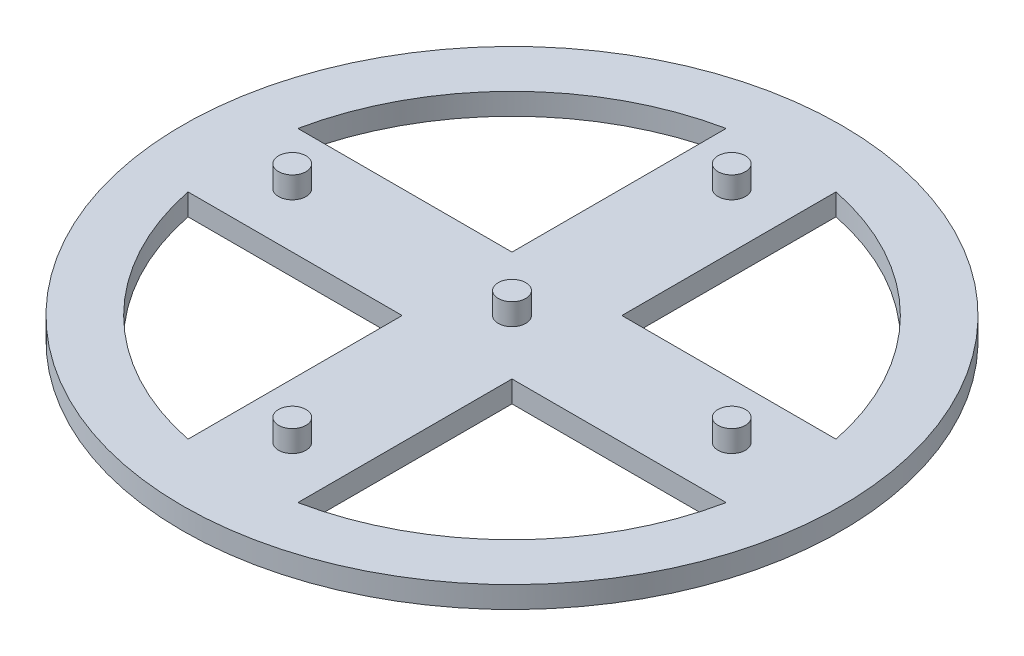
ISO-10303-21;
HEADER;
FILE_DESCRIPTION(('STEP AP214'),'2;1');
FILE_NAME('part.step','',(''),(''),'','','');
FILE_SCHEMA(('AUTOMOTIVE_DESIGN { 1 0 10303 214 1 1 1 1 }'));
ENDSEC;
DATA;
#1=APPLICATION_CONTEXT('core data for automotive mechanical design processes');
#2=APPLICATION_PROTOCOL_DEFINITION('international standard','automotive_design',2000,#1);
#3=PRODUCT_CONTEXT('',#1,'mechanical');
#4=PRODUCT('Part','Part','',(#3));
#5=PRODUCT_RELATED_PRODUCT_CATEGORY('part','',(#4));
#6=PRODUCT_DEFINITION_FORMATION('','',#4);
#7=PRODUCT_DEFINITION_CONTEXT('part definition',#1,'design');
#8=PRODUCT_DEFINITION('design','',#6,#7);
#9=PRODUCT_DEFINITION_SHAPE('','',#8);
#10=(LENGTH_UNIT() NAMED_UNIT(*) SI_UNIT(.MILLI.,.METRE.));
#11=(NAMED_UNIT(*) PLANE_ANGLE_UNIT() SI_UNIT($,.RADIAN.));
#12=(NAMED_UNIT(*) SI_UNIT($,.STERADIAN.) SOLID_ANGLE_UNIT());
#13=UNCERTAINTY_MEASURE_WITH_UNIT(LENGTH_MEASURE(1.E-05),#10,'distance_accuracy_value','');
#14=(GEOMETRIC_REPRESENTATION_CONTEXT(3) GLOBAL_UNCERTAINTY_ASSIGNED_CONTEXT((#13)) GLOBAL_UNIT_ASSIGNED_CONTEXT((#10,
#11,#12)) REPRESENTATION_CONTEXT('',''));
#15=CARTESIAN_POINT('',(0.,0.,0.));
#16=DIRECTION('',(0.,0.,1.));
#17=DIRECTION('',(1.,0.,0.));
#18=AXIS2_PLACEMENT_3D('',#15,#16,#17);
#19=CARTESIAN_POINT('',(0.,2.5,0.));
#20=DIRECTION('',(0.,-1.,0.));
#21=DIRECTION('',(0.,0.,-1.));
#22=AXIS2_PLACEMENT_3D('',#19,#20,#21);
#23=CYLINDRICAL_SURFACE('',#22,31.75);
#24=CARTESIAN_POINT('',(0.,0.,0.));
#25=DIRECTION('',(0.,1.,0.));
#26=DIRECTION('',(0.,0.,1.));
#27=AXIS2_PLACEMENT_3D('',#24,#25,#26);
#28=CIRCLE('',#27,31.75);
#29=CARTESIAN_POINT('',(31.1085197333464,0.,-6.35));
#30=VERTEX_POINT('',#29);
#31=CARTESIAN_POINT('',(6.35000000000001,0.,-31.1085197333464));
#32=VERTEX_POINT('',#31);
#33=EDGE_CURVE('E131',#30,#32,#28,.T.);
#34=ORIENTED_EDGE('',*,*,#33,.F.);
#35=DIRECTION('',(0.,-1.,0.));
#36=VECTOR('',#35,1.);
#37=CARTESIAN_POINT('',(31.1085197333464,2.5,-6.35));
#38=LINE('',#37,#36);
#39=CARTESIAN_POINT('',(31.1085197333464,2.5,-6.35));
#40=VERTEX_POINT('',#39);
#41=EDGE_CURVE('E11',#40,#30,#38,.T.);
#42=ORIENTED_EDGE('',*,*,#41,.F.);
#43=CARTESIAN_POINT('',(0.,2.5,0.));
#44=DIRECTION('',(0.,1.,0.));
#45=DIRECTION('',(0.,0.,1.));
#46=AXIS2_PLACEMENT_3D('',#43,#44,#45);
#47=CIRCLE('',#46,31.75);
#48=CARTESIAN_POINT('',(6.35000000000001,2.5,-31.1085197333464));
#49=VERTEX_POINT('',#48);
#50=EDGE_CURVE('E129',#40,#49,#47,.T.);
#51=ORIENTED_EDGE('',*,*,#50,.T.);
#52=DIRECTION('',(0.,-1.,0.));
#53=VECTOR('',#52,1.);
#54=CARTESIAN_POINT('',(6.35000000000001,2.5,-31.1085197333464));
#55=LINE('',#54,#53);
#56=EDGE_CURVE('E97',#49,#32,#55,.T.);
#57=ORIENTED_EDGE('',*,*,#56,.T.);
#58=EDGE_LOOP('',(#34,#42,#51,#57));
#59=FACE_BOUND('',#58,.T.);
#60=ADVANCED_FACE('F33',(#59),#23,.F.);
#61=CARTESIAN_POINT('',(0.,2.5,-6.35));
#62=DIRECTION('',(0.,0.,-1.));
#63=DIRECTION('',(-1.,0.,0.));
#64=AXIS2_PLACEMENT_3D('',#61,#62,#63);
#65=PLANE('',#64);
#66=DIRECTION('',(1.,0.,0.));
#67=VECTOR('',#66,1.);
#68=CARTESIAN_POINT('',(0.,0.,-6.35));
#69=LINE('',#68,#67);
#70=CARTESIAN_POINT('',(6.35000000000001,0.,-6.35));
#71=VERTEX_POINT('',#70);
#72=EDGE_CURVE('E179',#71,#30,#69,.T.);
#73=ORIENTED_EDGE('',*,*,#72,.F.);
#74=DIRECTION('',(0.,-1.,0.));
#75=VECTOR('',#74,1.);
#76=CARTESIAN_POINT('',(6.35000000000001,2.5,-6.35));
#77=LINE('',#76,#75);
#78=CARTESIAN_POINT('',(6.35000000000001,2.5,-6.35));
#79=VERTEX_POINT('',#78);
#80=EDGE_CURVE('E43',#79,#71,#77,.T.);
#81=ORIENTED_EDGE('',*,*,#80,.F.);
#82=DIRECTION('',(1.,0.,0.));
#83=VECTOR('',#82,1.);
#84=CARTESIAN_POINT('',(0.,2.5,-6.35));
#85=LINE('',#84,#83);
#86=EDGE_CURVE('E138',#79,#40,#85,.T.);
#87=ORIENTED_EDGE('',*,*,#86,.T.);
#88=ORIENTED_EDGE('',*,*,#41,.T.);
#89=EDGE_LOOP('',(#73,#81,#87,#88));
#90=FACE_BOUND('',#89,.T.);
#91=ADVANCED_FACE('F141',(#90),#65,.T.);
#92=CARTESIAN_POINT('',(0.,2.5,0.));
#93=DIRECTION('',(0.,-1.,0.));
#94=DIRECTION('',(0.,0.,-1.));
#95=AXIS2_PLACEMENT_3D('',#92,#93,#94);
#96=CYLINDRICAL_SURFACE('',#95,31.75);
#97=CARTESIAN_POINT('',(0.,0.,0.));
#98=DIRECTION('',(0.,1.,0.));
#99=DIRECTION('',(0.,0.,1.));
#100=AXIS2_PLACEMENT_3D('',#97,#98,#99);
#101=CIRCLE('',#100,31.75);
#102=CARTESIAN_POINT('',(-6.35,0.,-31.1085197333464));
#103=VERTEX_POINT('',#102);
#104=CARTESIAN_POINT('',(-31.1085197333464,0.,-6.35));
#105=VERTEX_POINT('',#104);
#106=EDGE_CURVE('E169',#103,#105,#101,.T.);
#107=ORIENTED_EDGE('',*,*,#106,.F.);
#108=DIRECTION('',(0.,-1.,0.));
#109=VECTOR('',#108,1.);
#110=CARTESIAN_POINT('',(-6.35,2.5,-31.1085197333464));
#111=LINE('',#110,#109);
#112=CARTESIAN_POINT('',(-6.35,2.5,-31.1085197333464));
#113=VERTEX_POINT('',#112);
#114=EDGE_CURVE('E188',#113,#103,#111,.T.);
#115=ORIENTED_EDGE('',*,*,#114,.F.);
#116=CARTESIAN_POINT('',(0.,2.5,0.));
#117=DIRECTION('',(0.,1.,0.));
#118=DIRECTION('',(0.,0.,1.));
#119=AXIS2_PLACEMENT_3D('',#116,#117,#118);
#120=CIRCLE('',#119,31.75);
#121=CARTESIAN_POINT('',(-31.1085197333464,2.5,-6.35));
#122=VERTEX_POINT('',#121);
#123=EDGE_CURVE('E230',#113,#122,#120,.T.);
#124=ORIENTED_EDGE('',*,*,#123,.T.);
#125=DIRECTION('',(0.,-1.,0.));
#126=VECTOR('',#125,1.);
#127=CARTESIAN_POINT('',(-31.1085197333464,2.5,-6.35));
#128=LINE('',#127,#126);
#129=EDGE_CURVE('E190',#122,#105,#128,.T.);
#130=ORIENTED_EDGE('',*,*,#129,.T.);
#131=EDGE_LOOP('',(#107,#115,#124,#130));
#132=FACE_BOUND('',#131,.T.);
#133=ADVANCED_FACE('F250',(#132),#96,.F.);
#134=CARTESIAN_POINT('',(-6.35,2.5,0.));
#135=DIRECTION('',(1.,0.,0.));
#136=DIRECTION('',(0.,0.,-1.));
#137=AXIS2_PLACEMENT_3D('',#134,#135,#136);
#138=PLANE('',#137);
#139=DIRECTION('',(0.,0.,1.));
#140=VECTOR('',#139,1.);
#141=CARTESIAN_POINT('',(-6.35,0.,0.));
#142=LINE('',#141,#140);
#143=CARTESIAN_POINT('',(-6.35,0.,-6.35));
#144=VERTEX_POINT('',#143);
#145=EDGE_CURVE('E172',#103,#144,#142,.T.);
#146=ORIENTED_EDGE('',*,*,#145,.T.);
#147=DIRECTION('',(0.,-1.,0.));
#148=VECTOR('',#147,1.);
#149=CARTESIAN_POINT('',(-6.35,2.5,-6.35));
#150=LINE('',#149,#148);
#151=CARTESIAN_POINT('',(-6.35,2.5,-6.35));
#152=VERTEX_POINT('',#151);
#153=EDGE_CURVE('E192',#152,#144,#150,.T.);
#154=ORIENTED_EDGE('',*,*,#153,.F.);
#155=DIRECTION('',(0.,0.,1.));
#156=VECTOR('',#155,1.);
#157=CARTESIAN_POINT('',(-6.35,2.5,0.));
#158=LINE('',#157,#156);
#159=EDGE_CURVE('E233',#113,#152,#158,.T.);
#160=ORIENTED_EDGE('',*,*,#159,.F.);
#161=ORIENTED_EDGE('',*,*,#114,.T.);
#162=EDGE_LOOP('',(#146,#154,#160,#161));
#163=FACE_BOUND('',#162,.T.);
#164=ADVANCED_FACE('F244',(#163),#138,.F.);
#165=CARTESIAN_POINT('',(0.,2.5,0.));
#166=DIRECTION('',(0.,-1.,0.));
#167=DIRECTION('',(0.,0.,-1.));
#168=AXIS2_PLACEMENT_3D('',#165,#166,#167);
#169=CYLINDRICAL_SURFACE('',#168,31.75);
#170=CARTESIAN_POINT('',(0.,0.,0.));
#171=DIRECTION('',(0.,1.,0.));
#172=DIRECTION('',(0.,0.,1.));
#173=AXIS2_PLACEMENT_3D('',#170,#171,#172);
#174=CIRCLE('',#173,31.75);
#175=CARTESIAN_POINT('',(-31.1085197333464,0.,6.35000000000001));
#176=VERTEX_POINT('',#175);
#177=CARTESIAN_POINT('',(-6.35,0.,31.1085197333464));
#178=VERTEX_POINT('',#177);
#179=EDGE_CURVE('E160',#176,#178,#174,.T.);
#180=ORIENTED_EDGE('',*,*,#179,.F.);
#181=DIRECTION('',(0.,-1.,0.));
#182=VECTOR('',#181,1.);
#183=CARTESIAN_POINT('',(-31.1085197333464,2.5,6.35000000000001));
#184=LINE('',#183,#182);
#185=CARTESIAN_POINT('',(-31.1085197333464,2.5,6.35000000000001));
#186=VERTEX_POINT('',#185);
#187=EDGE_CURVE('E193',#186,#176,#184,.T.);
#188=ORIENTED_EDGE('',*,*,#187,.F.);
#189=CARTESIAN_POINT('',(0.,2.5,0.));
#190=DIRECTION('',(0.,1.,0.));
#191=DIRECTION('',(0.,0.,1.));
#192=AXIS2_PLACEMENT_3D('',#189,#190,#191);
#193=CIRCLE('',#192,31.75);
#194=CARTESIAN_POINT('',(-6.35,2.5,31.1085197333464));
#195=VERTEX_POINT('',#194);
#196=EDGE_CURVE('E218',#186,#195,#193,.T.);
#197=ORIENTED_EDGE('',*,*,#196,.T.);
#198=DIRECTION('',(0.,-1.,0.));
#199=VECTOR('',#198,1.);
#200=CARTESIAN_POINT('',(-6.35,2.5,31.1085197333464));
#201=LINE('',#200,#199);
#202=EDGE_CURVE('E196',#195,#178,#201,.T.);
#203=ORIENTED_EDGE('',*,*,#202,.T.);
#204=EDGE_LOOP('',(#180,#188,#197,#203));
#205=FACE_BOUND('',#204,.T.);
#206=ADVANCED_FACE('F257',(#205),#169,.F.);
#207=CARTESIAN_POINT('',(0.,2.5,6.35));
#208=DIRECTION('',(0.,0.,1.));
#209=DIRECTION('',(1.,0.,0.));
#210=AXIS2_PLACEMENT_3D('',#207,#208,#209);
#211=PLANE('',#210);
#212=DIRECTION('',(-1.,0.,0.));
#213=VECTOR('',#212,1.);
#214=CARTESIAN_POINT('',(0.,0.,6.35));
#215=LINE('',#214,#213);
#216=CARTESIAN_POINT('',(-6.35,0.,6.35));
#217=VERTEX_POINT('',#216);
#218=EDGE_CURVE('E163',#217,#176,#215,.T.);
#219=ORIENTED_EDGE('',*,*,#218,.F.);
#220=DIRECTION('',(0.,-1.,0.));
#221=VECTOR('',#220,1.);
#222=CARTESIAN_POINT('',(-6.35,2.5,6.35));
#223=LINE('',#222,#221);
#224=CARTESIAN_POINT('',(-6.35,2.5,6.35));
#225=VERTEX_POINT('',#224);
#226=EDGE_CURVE('E198',#225,#217,#223,.T.);
#227=ORIENTED_EDGE('',*,*,#226,.F.);
#228=DIRECTION('',(-1.,0.,0.));
#229=VECTOR('',#228,1.);
#230=CARTESIAN_POINT('',(0.,2.5,6.35));
#231=LINE('',#230,#229);
#232=EDGE_CURVE('E221',#225,#186,#231,.T.);
#233=ORIENTED_EDGE('',*,*,#232,.T.);
#234=ORIENTED_EDGE('',*,*,#187,.T.);
#235=EDGE_LOOP('',(#219,#227,#233,#234));
#236=FACE_BOUND('',#235,.T.);
#237=ADVANCED_FACE('F370',(#236),#211,.T.);
#238=CARTESIAN_POINT('',(0.,2.5,0.));
#239=DIRECTION('',(0.,-1.,0.));
#240=DIRECTION('',(0.,0.,-1.));
#241=AXIS2_PLACEMENT_3D('',#238,#239,#240);
#242=CYLINDRICAL_SURFACE('',#241,31.75);
#243=CARTESIAN_POINT('',(0.,0.,0.));
#244=DIRECTION('',(0.,1.,0.));
#245=DIRECTION('',(0.,0.,1.));
#246=AXIS2_PLACEMENT_3D('',#243,#244,#245);
#247=CIRCLE('',#246,31.75);
#248=CARTESIAN_POINT('',(6.35000000000001,0.,31.1085197333464));
#249=VERTEX_POINT('',#248);
#250=CARTESIAN_POINT('',(31.1085197333464,0.,6.35));
#251=VERTEX_POINT('',#250);
#252=EDGE_CURVE('E150',#249,#251,#247,.T.);
#253=ORIENTED_EDGE('',*,*,#252,.F.);
#254=DIRECTION('',(0.,-1.,0.));
#255=VECTOR('',#254,1.);
#256=CARTESIAN_POINT('',(6.35000000000001,2.5,31.1085197333464));
#257=LINE('',#256,#255);
#258=CARTESIAN_POINT('',(6.35000000000001,2.5,31.1085197333464));
#259=VERTEX_POINT('',#258);
#260=EDGE_CURVE('E37',#259,#249,#257,.T.);
#261=ORIENTED_EDGE('',*,*,#260,.F.);
#262=CARTESIAN_POINT('',(0.,2.5,0.));
#263=DIRECTION('',(0.,1.,0.));
#264=DIRECTION('',(0.,0.,1.));
#265=AXIS2_PLACEMENT_3D('',#262,#263,#264);
#266=CIRCLE('',#265,31.75);
#267=CARTESIAN_POINT('',(31.1085197333464,2.5,6.35));
#268=VERTEX_POINT('',#267);
#269=EDGE_CURVE('E186',#259,#268,#266,.T.);
#270=ORIENTED_EDGE('',*,*,#269,.T.);
#271=DIRECTION('',(0.,-1.,0.));
#272=VECTOR('',#271,1.);
#273=CARTESIAN_POINT('',(31.1085197333464,2.5,6.35));
#274=LINE('',#273,#272);
#275=EDGE_CURVE('E149',#268,#251,#274,.T.);
#276=ORIENTED_EDGE('',*,*,#275,.T.);
#277=EDGE_LOOP('',(#253,#261,#270,#276));
#278=FACE_BOUND('',#277,.T.);
#279=ADVANCED_FACE('F35',(#278),#242,.F.);
#280=CARTESIAN_POINT('',(6.35,2.5,0.));
#281=DIRECTION('',(-1.,0.,0.));
#282=DIRECTION('',(0.,0.,1.));
#283=AXIS2_PLACEMENT_3D('',#280,#281,#282);
#284=PLANE('',#283);
#285=DIRECTION('',(0.,0.,-1.));
#286=VECTOR('',#285,1.);
#287=CARTESIAN_POINT('',(6.35,0.,0.));
#288=LINE('',#287,#286);
#289=CARTESIAN_POINT('',(6.35,0.,6.35));
#290=VERTEX_POINT('',#289);
#291=EDGE_CURVE('E153',#249,#290,#288,.T.);
#292=ORIENTED_EDGE('',*,*,#291,.T.);
#293=DIRECTION('',(0.,-1.,0.));
#294=VECTOR('',#293,1.);
#295=CARTESIAN_POINT('',(6.35,2.5,6.35));
#296=LINE('',#295,#294);
#297=CARTESIAN_POINT('',(6.35,2.5,6.35));
#298=VERTEX_POINT('',#297);
#299=EDGE_CURVE('E201',#298,#290,#296,.T.);
#300=ORIENTED_EDGE('',*,*,#299,.F.);
#301=DIRECTION('',(0.,0.,-1.));
#302=VECTOR('',#301,1.);
#303=CARTESIAN_POINT('',(6.35,2.5,0.));
#304=LINE('',#303,#302);
#305=EDGE_CURVE('E209',#259,#298,#304,.T.);
#306=ORIENTED_EDGE('',*,*,#305,.F.);
#307=ORIENTED_EDGE('',*,*,#260,.T.);
#308=EDGE_LOOP('',(#292,#300,#306,#307));
#309=FACE_BOUND('',#308,.T.);
#310=ADVANCED_FACE('F208',(#309),#284,.F.);
#311=CARTESIAN_POINT('',(6.35000000000001,2.5,0.));
#312=DIRECTION('',(-1.,0.,0.));
#313=DIRECTION('',(0.,0.,1.));
#314=AXIS2_PLACEMENT_3D('',#311,#312,#313);
#315=PLANE('',#314);
#316=DIRECTION('',(0.,0.,-1.));
#317=VECTOR('',#316,1.);
#318=CARTESIAN_POINT('',(6.35000000000001,0.,0.));
#319=LINE('',#318,#317);
#320=EDGE_CURVE('E181',#71,#32,#319,.T.);
#321=ORIENTED_EDGE('',*,*,#320,.T.);
#322=ORIENTED_EDGE('',*,*,#56,.F.);
#323=DIRECTION('',(0.,0.,-1.));
#324=VECTOR('',#323,1.);
#325=CARTESIAN_POINT('',(6.35000000000001,2.5,0.));
#326=LINE('',#325,#324);
#327=EDGE_CURVE('E52',#79,#49,#326,.T.);
#328=ORIENTED_EDGE('',*,*,#327,.F.);
#329=ORIENTED_EDGE('',*,*,#80,.T.);
#330=EDGE_LOOP('',(#321,#322,#328,#329));
#331=FACE_BOUND('',#330,.T.);
#332=ADVANCED_FACE('F269',(#331),#315,.F.);
#333=CARTESIAN_POINT('',(0.,2.5,-6.35));
#334=DIRECTION('',(0.,0.,-1.));
#335=DIRECTION('',(-1.,0.,0.));
#336=AXIS2_PLACEMENT_3D('',#333,#334,#335);
#337=PLANE('',#336);
#338=DIRECTION('',(1.,0.,0.));
#339=VECTOR('',#338,1.);
#340=CARTESIAN_POINT('',(0.,0.,-6.35));
#341=LINE('',#340,#339);
#342=EDGE_CURVE('E175',#105,#144,#341,.T.);
#343=ORIENTED_EDGE('',*,*,#342,.F.);
#344=ORIENTED_EDGE('',*,*,#129,.F.);
#345=DIRECTION('',(1.,0.,0.));
#346=VECTOR('',#345,1.);
#347=CARTESIAN_POINT('',(0.,2.5,-6.35));
#348=LINE('',#347,#346);
#349=EDGE_CURVE('E139',#122,#152,#348,.T.);
#350=ORIENTED_EDGE('',*,*,#349,.T.);
#351=ORIENTED_EDGE('',*,*,#153,.T.);
#352=EDGE_LOOP('',(#343,#344,#350,#351));
#353=FACE_BOUND('',#352,.T.);
#354=ADVANCED_FACE('F238',(#353),#337,.T.);
#355=CARTESIAN_POINT('',(-6.35,2.5,0.));
#356=DIRECTION('',(1.,0.,0.));
#357=DIRECTION('',(0.,0.,-1.));
#358=AXIS2_PLACEMENT_3D('',#355,#356,#357);
#359=PLANE('',#358);
#360=DIRECTION('',(0.,0.,1.));
#361=VECTOR('',#360,1.);
#362=CARTESIAN_POINT('',(-6.35,0.,0.));
#363=LINE('',#362,#361);
#364=EDGE_CURVE('E166',#217,#178,#363,.T.);
#365=ORIENTED_EDGE('',*,*,#364,.T.);
#366=ORIENTED_EDGE('',*,*,#202,.F.);
#367=DIRECTION('',(0.,0.,1.));
#368=VECTOR('',#367,1.);
#369=CARTESIAN_POINT('',(-6.35,2.5,0.));
#370=LINE('',#369,#368);
#371=EDGE_CURVE('E228',#225,#195,#370,.T.);
#372=ORIENTED_EDGE('',*,*,#371,.F.);
#373=ORIENTED_EDGE('',*,*,#226,.T.);
#374=EDGE_LOOP('',(#365,#366,#372,#373));
#375=FACE_BOUND('',#374,.T.);
#376=ADVANCED_FACE('F268',(#375),#359,.F.);
#377=CARTESIAN_POINT('',(0.,2.5,6.35000000000001));
#378=DIRECTION('',(0.,0.,1.));
#379=DIRECTION('',(1.,0.,0.));
#380=AXIS2_PLACEMENT_3D('',#377,#378,#379);
#381=PLANE('',#380);
#382=DIRECTION('',(-1.,0.,0.));
#383=VECTOR('',#382,1.);
#384=CARTESIAN_POINT('',(0.,0.,6.35000000000001));
#385=LINE('',#384,#383);
#386=EDGE_CURVE('E157',#251,#290,#385,.T.);
#387=ORIENTED_EDGE('',*,*,#386,.F.);
#388=ORIENTED_EDGE('',*,*,#275,.F.);
#389=DIRECTION('',(-1.,0.,0.));
#390=VECTOR('',#389,1.);
#391=CARTESIAN_POINT('',(0.,2.5,6.35000000000001));
#392=LINE('',#391,#390);
#393=EDGE_CURVE('E216',#268,#298,#392,.T.);
#394=ORIENTED_EDGE('',*,*,#393,.T.);
#395=ORIENTED_EDGE('',*,*,#299,.T.);
#396=EDGE_LOOP('',(#387,#388,#394,#395));
#397=FACE_BOUND('',#396,.T.);
#398=ADVANCED_FACE('F215',(#397),#381,.T.);
#399=CARTESIAN_POINT('',(0.,2.5,0.));
#400=DIRECTION('',(0.,-1.,0.));
#401=DIRECTION('',(0.,0.,-1.));
#402=AXIS2_PLACEMENT_3D('',#399,#400,#401);
#403=CYLINDRICAL_SURFACE('',#402,38.1);
#404=CARTESIAN_POINT('',(0.,2.5,0.));
#405=DIRECTION('',(0.,1.,0.));
#406=DIRECTION('',(0.,0.,1.));
#407=AXIS2_PLACEMENT_3D('',#404,#405,#406);
#408=CIRCLE('',#407,38.1);
#409=CARTESIAN_POINT('',(0.,2.5,38.1));
#410=VERTEX_POINT('',#409);
#411=EDGE_CURVE('E143',#410,#410,#408,.T.);
#412=ORIENTED_EDGE('',*,*,#411,.F.);
#413=EDGE_LOOP('',(#412));
#414=FACE_BOUND('',#413,.T.);
#415=CARTESIAN_POINT('',(0.,0.,0.));
#416=DIRECTION('',(0.,1.,0.));
#417=DIRECTION('',(0.,0.,1.));
#418=AXIS2_PLACEMENT_3D('',#415,#416,#417);
#419=CIRCLE('',#418,38.1);
#420=CARTESIAN_POINT('',(0.,0.,38.1));
#421=VERTEX_POINT('',#420);
#422=EDGE_CURVE('E183',#421,#421,#419,.T.);
#423=ORIENTED_EDGE('',*,*,#422,.T.);
#424=EDGE_LOOP('',(#423));
#425=FACE_BOUND('',#424,.T.);
#426=ADVANCED_FACE('F279',(#414,#425),#403,.T.);
#427=CARTESIAN_POINT('',(0.,2.5,0.));
#428=DIRECTION('',(0.,1.,0.));
#429=DIRECTION('',(0.,0.,1.));
#430=AXIS2_PLACEMENT_3D('',#427,#428,#429);
#431=PLANE('',#430);
#432=CARTESIAN_POINT('',(0.,2.5,25.4));
#433=DIRECTION('',(0.,1.,0.));
#434=DIRECTION('',(0.,0.,1.));
#435=AXIS2_PLACEMENT_3D('',#432,#433,#434);
#436=CIRCLE('',#435,1.5875);
#437=CARTESIAN_POINT('',(0.,2.5,26.9875));
#438=VERTEX_POINT('',#437);
#439=EDGE_CURVE('E333',#438,#438,#436,.T.);
#440=ORIENTED_EDGE('',*,*,#439,.F.);
#441=EDGE_LOOP('',(#440));
#442=FACE_BOUND('',#441,.T.);
#443=CARTESIAN_POINT('',(25.4,2.5,0.));
#444=DIRECTION('',(0.,1.,0.));
#445=DIRECTION('',(0.,0.,1.));
#446=AXIS2_PLACEMENT_3D('',#443,#444,#445);
#447=CIRCLE('',#446,1.5875);
#448=CARTESIAN_POINT('',(25.4,2.5,1.5875));
#449=VERTEX_POINT('',#448);
#450=EDGE_CURVE('E332',#449,#449,#447,.T.);
#451=ORIENTED_EDGE('',*,*,#450,.F.);
#452=EDGE_LOOP('',(#451));
#453=FACE_BOUND('',#452,.T.);
#454=CARTESIAN_POINT('',(0.,2.5,-25.4));
#455=DIRECTION('',(0.,1.,0.));
#456=DIRECTION('',(0.,0.,1.));
#457=AXIS2_PLACEMENT_3D('',#454,#455,#456);
#458=CIRCLE('',#457,1.5875);
#459=CARTESIAN_POINT('',(0.,2.5,-23.8125));
#460=VERTEX_POINT('',#459);
#461=EDGE_CURVE('E342',#460,#460,#458,.T.);
#462=ORIENTED_EDGE('',*,*,#461,.F.);
#463=EDGE_LOOP('',(#462));
#464=FACE_BOUND('',#463,.T.);
#465=CARTESIAN_POINT('',(-25.4,2.5,0.));
#466=DIRECTION('',(0.,1.,0.));
#467=DIRECTION('',(0.,0.,1.));
#468=AXIS2_PLACEMENT_3D('',#465,#466,#467);
#469=CIRCLE('',#468,1.5875);
#470=CARTESIAN_POINT('',(-25.4,2.5,1.5875));
#471=VERTEX_POINT('',#470);
#472=EDGE_CURVE('E347',#471,#471,#469,.T.);
#473=ORIENTED_EDGE('',*,*,#472,.F.);
#474=EDGE_LOOP('',(#473));
#475=FACE_BOUND('',#474,.T.);
#476=CARTESIAN_POINT('',(0.,2.5,0.));
#477=DIRECTION('',(0.,1.,0.));
#478=DIRECTION('',(0.,0.,1.));
#479=AXIS2_PLACEMENT_3D('',#476,#477,#478);
#480=CIRCLE('',#479,1.5875);
#481=CARTESIAN_POINT('',(0.,2.5,1.5875));
#482=VERTEX_POINT('',#481);
#483=EDGE_CURVE('E353',#482,#482,#480,.T.);
#484=ORIENTED_EDGE('',*,*,#483,.F.);
#485=EDGE_LOOP('',(#484));
#486=FACE_BOUND('',#485,.T.);
#487=ORIENTED_EDGE('',*,*,#269,.F.);
#488=ORIENTED_EDGE('',*,*,#305,.T.);
#489=ORIENTED_EDGE('',*,*,#393,.F.);
#490=EDGE_LOOP('',(#487,#488,#489));
#491=FACE_BOUND('',#490,.T.);
#492=ORIENTED_EDGE('',*,*,#196,.F.);
#493=ORIENTED_EDGE('',*,*,#232,.F.);
#494=ORIENTED_EDGE('',*,*,#371,.T.);
#495=EDGE_LOOP('',(#492,#493,#494));
#496=FACE_BOUND('',#495,.T.);
#497=ORIENTED_EDGE('',*,*,#123,.F.);
#498=ORIENTED_EDGE('',*,*,#159,.T.);
#499=ORIENTED_EDGE('',*,*,#349,.F.);
#500=EDGE_LOOP('',(#497,#498,#499));
#501=FACE_BOUND('',#500,.T.);
#502=ORIENTED_EDGE('',*,*,#50,.F.);
#503=ORIENTED_EDGE('',*,*,#86,.F.);
#504=ORIENTED_EDGE('',*,*,#327,.T.);
#505=EDGE_LOOP('',(#502,#503,#504));
#506=FACE_BOUND('',#505,.T.);
#507=ORIENTED_EDGE('',*,*,#411,.T.);
#508=EDGE_LOOP('',(#507));
#509=FACE_BOUND('',#508,.T.);
#510=ADVANCED_FACE('F136',(#442,#453,#464,#475,#486,#491,#496,#501,#506,#509),#431,.T.);
#511=CARTESIAN_POINT('',(0.,0.,0.));
#512=DIRECTION('',(0.,1.,0.));
#513=DIRECTION('',(0.,0.,1.));
#514=AXIS2_PLACEMENT_3D('',#511,#512,#513);
#515=PLANE('',#514);
#516=ORIENTED_EDGE('',*,*,#252,.T.);
#517=ORIENTED_EDGE('',*,*,#386,.T.);
#518=ORIENTED_EDGE('',*,*,#291,.F.);
#519=EDGE_LOOP('',(#516,#517,#518));
#520=FACE_BOUND('',#519,.T.);
#521=ORIENTED_EDGE('',*,*,#179,.T.);
#522=ORIENTED_EDGE('',*,*,#364,.F.);
#523=ORIENTED_EDGE('',*,*,#218,.T.);
#524=EDGE_LOOP('',(#521,#522,#523));
#525=FACE_BOUND('',#524,.T.);
#526=ORIENTED_EDGE('',*,*,#106,.T.);
#527=ORIENTED_EDGE('',*,*,#342,.T.);
#528=ORIENTED_EDGE('',*,*,#145,.F.);
#529=EDGE_LOOP('',(#526,#527,#528));
#530=FACE_BOUND('',#529,.T.);
#531=ORIENTED_EDGE('',*,*,#33,.T.);
#532=ORIENTED_EDGE('',*,*,#320,.F.);
#533=ORIENTED_EDGE('',*,*,#72,.T.);
#534=EDGE_LOOP('',(#531,#532,#533));
#535=FACE_BOUND('',#534,.T.);
#536=ORIENTED_EDGE('',*,*,#422,.F.);
#537=EDGE_LOOP('',(#536));
#538=FACE_BOUND('',#537,.T.);
#539=ADVANCED_FACE('F212',(#520,#525,#530,#535,#538),#515,.F.);
#540=CARTESIAN_POINT('',(0.,5.,0.));
#541=DIRECTION('',(0.,-1.,0.));
#542=DIRECTION('',(0.,0.,-1.));
#543=AXIS2_PLACEMENT_3D('',#540,#541,#542);
#544=CYLINDRICAL_SURFACE('',#543,1.5875);
#545=CARTESIAN_POINT('',(0.,5.,0.));
#546=DIRECTION('',(0.,1.,0.));
#547=DIRECTION('',(0.,0.,1.));
#548=AXIS2_PLACEMENT_3D('',#545,#546,#547);
#549=CIRCLE('',#548,1.5875);
#550=CARTESIAN_POINT('',(0.,5.,1.5875));
#551=VERTEX_POINT('',#550);
#552=EDGE_CURVE('E154',#551,#551,#549,.T.);
#553=ORIENTED_EDGE('',*,*,#552,.F.);
#554=EDGE_LOOP('',(#553));
#555=FACE_BOUND('',#554,.T.);
#556=ORIENTED_EDGE('',*,*,#483,.T.);
#557=EDGE_LOOP('',(#556));
#558=FACE_BOUND('',#557,.T.);
#559=ADVANCED_FACE('F285',(#555,#558),#544,.T.);
#560=CARTESIAN_POINT('',(0.,5.,0.));
#561=DIRECTION('',(0.,1.,0.));
#562=DIRECTION('',(0.,0.,1.));
#563=AXIS2_PLACEMENT_3D('',#560,#561,#562);
#564=PLANE('',#563);
#565=ORIENTED_EDGE('',*,*,#552,.T.);
#566=EDGE_LOOP('',(#565));
#567=FACE_BOUND('',#566,.T.);
#568=ADVANCED_FACE('F291',(#567),#564,.T.);
#569=CARTESIAN_POINT('',(-25.4,5.,0.));
#570=DIRECTION('',(0.,-1.,0.));
#571=DIRECTION('',(0.,0.,-1.));
#572=AXIS2_PLACEMENT_3D('',#569,#570,#571);
#573=CYLINDRICAL_SURFACE('',#572,1.5875);
#574=CARTESIAN_POINT('',(-25.4,5.,0.));
#575=DIRECTION('',(0.,1.,0.));
#576=DIRECTION('',(0.,0.,1.));
#577=AXIS2_PLACEMENT_3D('',#574,#575,#576);
#578=CIRCLE('',#577,1.5875);
#579=CARTESIAN_POINT('',(-25.4,5.,1.5875));
#580=VERTEX_POINT('',#579);
#581=EDGE_CURVE('E350',#580,#580,#578,.T.);
#582=ORIENTED_EDGE('',*,*,#581,.F.);
#583=EDGE_LOOP('',(#582));
#584=FACE_BOUND('',#583,.T.);
#585=ORIENTED_EDGE('',*,*,#472,.T.);
#586=EDGE_LOOP('',(#585));
#587=FACE_BOUND('',#586,.T.);
#588=ADVANCED_FACE('F295',(#584,#587),#573,.T.);
#589=CARTESIAN_POINT('',(-25.4,5.,0.));
#590=DIRECTION('',(0.,1.,0.));
#591=DIRECTION('',(0.,0.,1.));
#592=AXIS2_PLACEMENT_3D('',#589,#590,#591);
#593=PLANE('',#592);
#594=ORIENTED_EDGE('',*,*,#581,.T.);
#595=EDGE_LOOP('',(#594));
#596=FACE_BOUND('',#595,.T.);
#597=ADVANCED_FACE('F299',(#596),#593,.T.);
#598=CARTESIAN_POINT('',(0.,5.,-25.4));
#599=DIRECTION('',(0.,-1.,0.));
#600=DIRECTION('',(0.,0.,-1.));
#601=AXIS2_PLACEMENT_3D('',#598,#599,#600);
#602=CYLINDRICAL_SURFACE('',#601,1.5875);
#603=CARTESIAN_POINT('',(0.,5.,-25.4));
#604=DIRECTION('',(0.,1.,0.));
#605=DIRECTION('',(0.,0.,1.));
#606=AXIS2_PLACEMENT_3D('',#603,#604,#605);
#607=CIRCLE('',#606,1.5875);
#608=CARTESIAN_POINT('',(0.,5.,-23.8125));
#609=VERTEX_POINT('',#608);
#610=EDGE_CURVE('E344',#609,#609,#607,.T.);
#611=ORIENTED_EDGE('',*,*,#610,.F.);
#612=EDGE_LOOP('',(#611));
#613=FACE_BOUND('',#612,.T.);
#614=ORIENTED_EDGE('',*,*,#461,.T.);
#615=EDGE_LOOP('',(#614));
#616=FACE_BOUND('',#615,.T.);
#617=ADVANCED_FACE('F303',(#613,#616),#602,.T.);
#618=CARTESIAN_POINT('',(0.,5.,-25.4));
#619=DIRECTION('',(0.,1.,0.));
#620=DIRECTION('',(0.,0.,1.));
#621=AXIS2_PLACEMENT_3D('',#618,#619,#620);
#622=PLANE('',#621);
#623=ORIENTED_EDGE('',*,*,#610,.T.);
#624=EDGE_LOOP('',(#623));
#625=FACE_BOUND('',#624,.T.);
#626=ADVANCED_FACE('F307',(#625),#622,.T.);
#627=CARTESIAN_POINT('',(25.4,5.,0.));
#628=DIRECTION('',(0.,-1.,0.));
#629=DIRECTION('',(0.,0.,-1.));
#630=AXIS2_PLACEMENT_3D('',#627,#628,#629);
#631=CYLINDRICAL_SURFACE('',#630,1.5875);
#632=CARTESIAN_POINT('',(25.4,5.,0.));
#633=DIRECTION('',(0.,1.,0.));
#634=DIRECTION('',(0.,0.,1.));
#635=AXIS2_PLACEMENT_3D('',#632,#633,#634);
#636=CIRCLE('',#635,1.5875);
#637=CARTESIAN_POINT('',(25.4,5.,1.5875));
#638=VERTEX_POINT('',#637);
#639=EDGE_CURVE('E336',#638,#638,#636,.T.);
#640=ORIENTED_EDGE('',*,*,#639,.F.);
#641=EDGE_LOOP('',(#640));
#642=FACE_BOUND('',#641,.T.);
#643=ORIENTED_EDGE('',*,*,#450,.T.);
#644=EDGE_LOOP('',(#643));
#645=FACE_BOUND('',#644,.T.);
#646=ADVANCED_FACE('F311',(#642,#645),#631,.T.);
#647=CARTESIAN_POINT('',(25.4,5.,0.));
#648=DIRECTION('',(0.,1.,0.));
#649=DIRECTION('',(0.,0.,1.));
#650=AXIS2_PLACEMENT_3D('',#647,#648,#649);
#651=PLANE('',#650);
#652=ORIENTED_EDGE('',*,*,#639,.T.);
#653=EDGE_LOOP('',(#652));
#654=FACE_BOUND('',#653,.T.);
#655=ADVANCED_FACE('F315',(#654),#651,.T.);
#656=CARTESIAN_POINT('',(0.,5.,25.4));
#657=DIRECTION('',(0.,-1.,0.));
#658=DIRECTION('',(0.,0.,-1.));
#659=AXIS2_PLACEMENT_3D('',#656,#657,#658);
#660=CYLINDRICAL_SURFACE('',#659,1.5875);
#661=CARTESIAN_POINT('',(0.,5.,25.4));
#662=DIRECTION('',(0.,1.,0.));
#663=DIRECTION('',(0.,0.,1.));
#664=AXIS2_PLACEMENT_3D('',#661,#662,#663);
#665=CIRCLE('',#664,1.5875);
#666=CARTESIAN_POINT('',(0.,5.,26.9875));
#667=VERTEX_POINT('',#666);
#668=EDGE_CURVE('E331',#667,#667,#665,.T.);
#669=ORIENTED_EDGE('',*,*,#668,.F.);
#670=EDGE_LOOP('',(#669));
#671=FACE_BOUND('',#670,.T.);
#672=ORIENTED_EDGE('',*,*,#439,.T.);
#673=EDGE_LOOP('',(#672));
#674=FACE_BOUND('',#673,.T.);
#675=ADVANCED_FACE('F319',(#671,#674),#660,.T.);
#676=CARTESIAN_POINT('',(0.,5.,25.4));
#677=DIRECTION('',(0.,1.,0.));
#678=DIRECTION('',(0.,0.,1.));
#679=AXIS2_PLACEMENT_3D('',#676,#677,#678);
#680=PLANE('',#679);
#681=ORIENTED_EDGE('',*,*,#668,.T.);
#682=EDGE_LOOP('',(#681));
#683=FACE_BOUND('',#682,.T.);
#684=ADVANCED_FACE('F323',(#683),#680,.T.);
#685=CLOSED_SHELL('',(#60,#91,#133,#164,#206,#237,#279,#310,#332,#354,#376,#398,#426,#510,#539,
#559,#568,#588,#597,#617,#626,#646,#655,#675,#684));
#686=MANIFOLD_SOLID_BREP('B2',#685);
#687=ADVANCED_BREP_SHAPE_REPRESENTATION('',(#18,#686),#14);
#688=SHAPE_DEFINITION_REPRESENTATION(#9,#687);
ENDSEC;
END-ISO-10303-21;
